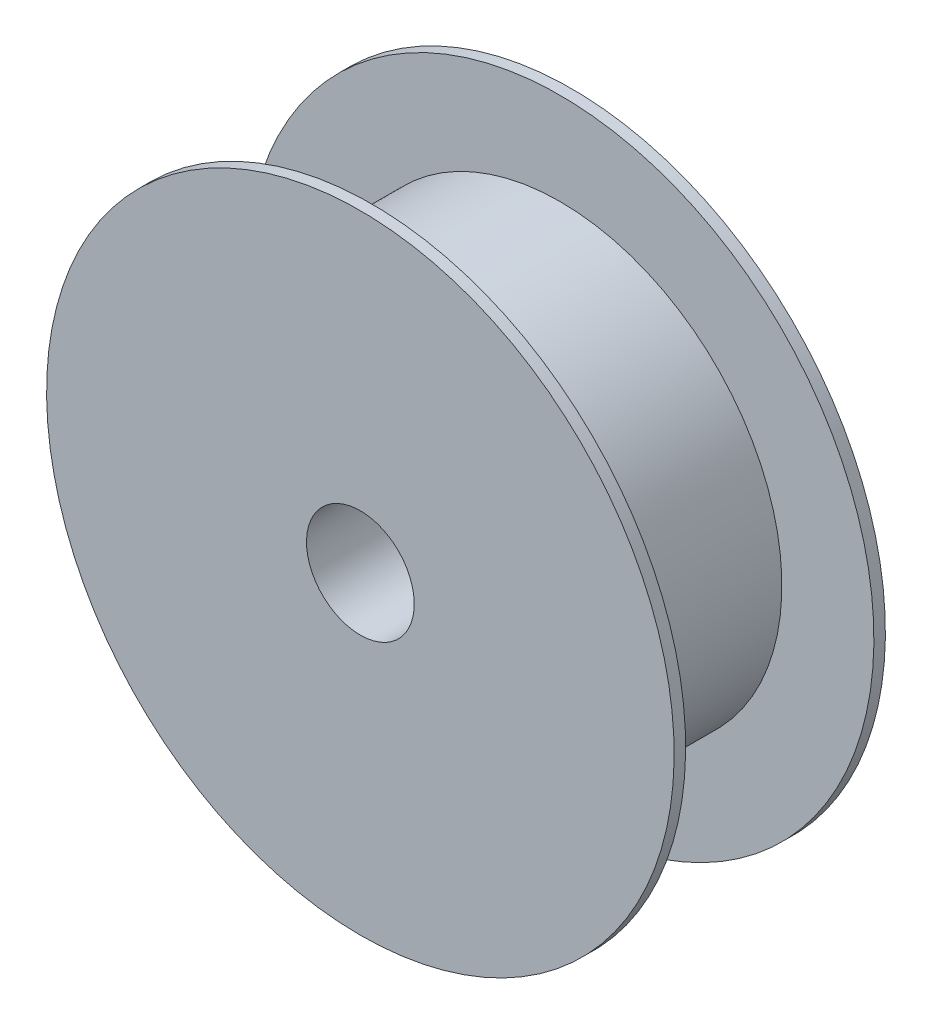
ISO-10303-21;
HEADER;
FILE_DESCRIPTION(('STEP AP214'),'2;1');
FILE_NAME('part.step','',(''),(''),'','','');
FILE_SCHEMA(('AUTOMOTIVE_DESIGN { 1 0 10303 214 1 1 1 1 }'));
ENDSEC;
DATA;
#1=APPLICATION_CONTEXT('core data for automotive mechanical design processes');
#2=APPLICATION_PROTOCOL_DEFINITION('international standard','automotive_design',2000,#1);
#3=PRODUCT_CONTEXT('',#1,'mechanical');
#4=PRODUCT('Part','Part','',(#3));
#5=PRODUCT_RELATED_PRODUCT_CATEGORY('part','',(#4));
#6=PRODUCT_DEFINITION_FORMATION('','',#4);
#7=PRODUCT_DEFINITION_CONTEXT('part definition',#1,'design');
#8=PRODUCT_DEFINITION('design','',#6,#7);
#9=PRODUCT_DEFINITION_SHAPE('','',#8);
#10=(LENGTH_UNIT() NAMED_UNIT(*) SI_UNIT(.MILLI.,.METRE.));
#11=(NAMED_UNIT(*) PLANE_ANGLE_UNIT() SI_UNIT($,.RADIAN.));
#12=(NAMED_UNIT(*) SI_UNIT($,.STERADIAN.) SOLID_ANGLE_UNIT());
#13=UNCERTAINTY_MEASURE_WITH_UNIT(LENGTH_MEASURE(1.E-05),#10,'distance_accuracy_value','');
#14=(GEOMETRIC_REPRESENTATION_CONTEXT(3) GLOBAL_UNCERTAINTY_ASSIGNED_CONTEXT((#13)) GLOBAL_UNIT_ASSIGNED_CONTEXT((#10,
#11,#12)) REPRESENTATION_CONTEXT('',''));
#15=CARTESIAN_POINT('',(0.,0.,0.));
#16=DIRECTION('',(0.,0.,1.));
#17=DIRECTION('',(1.,0.,0.));
#18=AXIS2_PLACEMENT_3D('',#15,#16,#17);
#19=CARTESIAN_POINT('',(0.,0.,50.5000000000001));
#20=DIRECTION('',(0.,0.,-1.));
#21=DIRECTION('',(0.,1.,0.));
#22=AXIS2_PLACEMENT_3D('',#19,#20,#21);
#23=PLANE('',#22);
#24=CARTESIAN_POINT('',(0.,0.,50.5));
#25=DIRECTION('',(0.,0.,1.));
#26=DIRECTION('',(0.,-1.,0.));
#27=AXIS2_PLACEMENT_3D('',#24,#25,#26);
#28=CIRCLE('',#27,25.7499999999999);
#29=CARTESIAN_POINT('',(0.,-25.7499999999999,50.5));
#30=VERTEX_POINT('',#29);
#31=EDGE_CURVE('E10',#30,#30,#28,.T.);
#32=ORIENTED_EDGE('',*,*,#31,.F.);
#33=EDGE_LOOP('',(#32));
#34=FACE_BOUND('',#33,.T.);
#35=CARTESIAN_POINT('',(0.,0.,50.5000000000001));
#36=DIRECTION('',(0.,0.,1.));
#37=DIRECTION('',(0.,-1.,0.));
#38=AXIS2_PLACEMENT_3D('',#35,#36,#37);
#39=CIRCLE('',#38,150.);
#40=CARTESIAN_POINT('',(0.,-150.,50.5000000000001));
#41=VERTEX_POINT('',#40);
#42=EDGE_CURVE('E60',#41,#41,#39,.T.);
#43=ORIENTED_EDGE('',*,*,#42,.T.);
#44=EDGE_LOOP('',(#43));
#45=FACE_BOUND('',#44,.T.);
#46=ADVANCED_FACE('F32',(#34,#45),#23,.F.);
#47=CARTESIAN_POINT('',(0.,0.,50.5));
#48=DIRECTION('',(0.,0.,1.));
#49=DIRECTION('',(0.,-1.,0.));
#50=AXIS2_PLACEMENT_3D('',#47,#48,#49);
#51=CYLINDRICAL_SURFACE('',#50,25.7499999999999);
#52=CARTESIAN_POINT('',(0.,0.,-50.5));
#53=DIRECTION('',(0.,0.,1.));
#54=DIRECTION('',(0.,-1.,0.));
#55=AXIS2_PLACEMENT_3D('',#52,#53,#54);
#56=CIRCLE('',#55,25.7499999999999);
#57=CARTESIAN_POINT('',(0.,-25.7499999999999,-50.5));
#58=VERTEX_POINT('',#57);
#59=EDGE_CURVE('E38',#58,#58,#56,.T.);
#60=ORIENTED_EDGE('',*,*,#59,.F.);
#61=EDGE_LOOP('',(#60));
#62=FACE_BOUND('',#61,.T.);
#63=ORIENTED_EDGE('',*,*,#31,.T.);
#64=EDGE_LOOP('',(#63));
#65=FACE_BOUND('',#64,.T.);
#66=ADVANCED_FACE('F77',(#62,#65),#51,.F.);
#67=CARTESIAN_POINT('',(0.,0.,-50.4999999999999));
#68=DIRECTION('',(0.,0.,-1.));
#69=DIRECTION('',(0.,1.,0.));
#70=AXIS2_PLACEMENT_3D('',#67,#68,#69);
#71=PLANE('',#70);
#72=ORIENTED_EDGE('',*,*,#59,.T.);
#73=EDGE_LOOP('',(#72));
#74=FACE_BOUND('',#73,.T.);
#75=CARTESIAN_POINT('',(0.,0.,-50.4999999999999));
#76=DIRECTION('',(0.,0.,1.));
#77=DIRECTION('',(0.,-1.,0.));
#78=AXIS2_PLACEMENT_3D('',#75,#76,#77);
#79=CIRCLE('',#78,150.);
#80=CARTESIAN_POINT('',(0.,-150.,-50.4999999999999));
#81=VERTEX_POINT('',#80);
#82=EDGE_CURVE('E42',#81,#81,#79,.T.);
#83=ORIENTED_EDGE('',*,*,#82,.F.);
#84=EDGE_LOOP('',(#83));
#85=FACE_BOUND('',#84,.T.);
#86=ADVANCED_FACE('F82',(#74,#85),#71,.T.);
#87=CARTESIAN_POINT('',(0.,0.,50.5));
#88=DIRECTION('',(0.,0.,1.));
#89=DIRECTION('',(0.,-1.,0.));
#90=AXIS2_PLACEMENT_3D('',#87,#88,#89);
#91=CYLINDRICAL_SURFACE('',#90,150.);
#92=ORIENTED_EDGE('',*,*,#82,.T.);
#93=EDGE_LOOP('',(#92));
#94=FACE_BOUND('',#93,.T.);
#95=CARTESIAN_POINT('',(0.,0.,-45.));
#96=DIRECTION('',(0.,0.,1.));
#97=DIRECTION('',(0.,-1.,0.));
#98=AXIS2_PLACEMENT_3D('',#95,#96,#97);
#99=CIRCLE('',#98,150.);
#100=CARTESIAN_POINT('',(0.,-150.,-45.));
#101=VERTEX_POINT('',#100);
#102=EDGE_CURVE('E46',#101,#101,#99,.T.);
#103=ORIENTED_EDGE('',*,*,#102,.F.);
#104=EDGE_LOOP('',(#103));
#105=FACE_BOUND('',#104,.T.);
#106=ADVANCED_FACE('F87',(#94,#105),#91,.T.);
#107=CARTESIAN_POINT('',(0.,0.,-45.));
#108=DIRECTION('',(0.,0.,-1.));
#109=DIRECTION('',(0.,1.,0.));
#110=AXIS2_PLACEMENT_3D('',#107,#108,#109);
#111=PLANE('',#110);
#112=CARTESIAN_POINT('',(0.,0.,-45.));
#113=DIRECTION('',(0.,0.,1.));
#114=DIRECTION('',(0.,-1.,0.));
#115=AXIS2_PLACEMENT_3D('',#112,#113,#114);
#116=CIRCLE('',#115,106.);
#117=CARTESIAN_POINT('',(0.,-106.,-45.));
#118=VERTEX_POINT('',#117);
#119=EDGE_CURVE('E51',#118,#118,#116,.T.);
#120=ORIENTED_EDGE('',*,*,#119,.F.);
#121=EDGE_LOOP('',(#120));
#122=FACE_BOUND('',#121,.T.);
#123=ORIENTED_EDGE('',*,*,#102,.T.);
#124=EDGE_LOOP('',(#123));
#125=FACE_BOUND('',#124,.T.);
#126=ADVANCED_FACE('F92',(#122,#125),#111,.F.);
#127=CARTESIAN_POINT('',(0.,0.,50.5));
#128=DIRECTION('',(0.,0.,1.));
#129=DIRECTION('',(0.,-1.,0.));
#130=AXIS2_PLACEMENT_3D('',#127,#128,#129);
#131=CYLINDRICAL_SURFACE('',#130,106.);
#132=CARTESIAN_POINT('',(0.,0.,45.));
#133=DIRECTION('',(0.,0.,1.));
#134=DIRECTION('',(0.,-1.,0.));
#135=AXIS2_PLACEMENT_3D('',#132,#133,#134);
#136=CIRCLE('',#135,106.);
#137=CARTESIAN_POINT('',(0.,-106.,45.));
#138=VERTEX_POINT('',#137);
#139=EDGE_CURVE('E54',#138,#138,#136,.T.);
#140=ORIENTED_EDGE('',*,*,#139,.F.);
#141=EDGE_LOOP('',(#140));
#142=FACE_BOUND('',#141,.T.);
#143=ORIENTED_EDGE('',*,*,#119,.T.);
#144=EDGE_LOOP('',(#143));
#145=FACE_BOUND('',#144,.T.);
#146=ADVANCED_FACE('F73',(#142,#145),#131,.T.);
#147=CARTESIAN_POINT('',(0.,0.,45.));
#148=DIRECTION('',(0.,0.,-1.));
#149=DIRECTION('',(0.,1.,0.));
#150=AXIS2_PLACEMENT_3D('',#147,#148,#149);
#151=PLANE('',#150);
#152=ORIENTED_EDGE('',*,*,#139,.T.);
#153=EDGE_LOOP('',(#152));
#154=FACE_BOUND('',#153,.T.);
#155=CARTESIAN_POINT('',(0.,0.,45.));
#156=DIRECTION('',(0.,0.,1.));
#157=DIRECTION('',(0.,-1.,0.));
#158=AXIS2_PLACEMENT_3D('',#155,#156,#157);
#159=CIRCLE('',#158,150.);
#160=CARTESIAN_POINT('',(0.,-150.,45.));
#161=VERTEX_POINT('',#160);
#162=EDGE_CURVE('E57',#161,#161,#159,.T.);
#163=ORIENTED_EDGE('',*,*,#162,.F.);
#164=EDGE_LOOP('',(#163));
#165=FACE_BOUND('',#164,.T.);
#166=ADVANCED_FACE('F67',(#154,#165),#151,.T.);
#167=CARTESIAN_POINT('',(0.,0.,50.5));
#168=DIRECTION('',(0.,0.,1.));
#169=DIRECTION('',(0.,-1.,0.));
#170=AXIS2_PLACEMENT_3D('',#167,#168,#169);
#171=CYLINDRICAL_SURFACE('',#170,150.);
#172=ORIENTED_EDGE('',*,*,#162,.T.);
#173=EDGE_LOOP('',(#172));
#174=FACE_BOUND('',#173,.T.);
#175=ORIENTED_EDGE('',*,*,#42,.F.);
#176=EDGE_LOOP('',(#175));
#177=FACE_BOUND('',#176,.T.);
#178=ADVANCED_FACE('F65',(#174,#177),#171,.T.);
#179=CLOSED_SHELL('',(#46,#66,#86,#106,#126,#146,#166,#178));
#180=MANIFOLD_SOLID_BREP('B2',#179);
#181=ADVANCED_BREP_SHAPE_REPRESENTATION('',(#18,#180),#14);
#182=SHAPE_DEFINITION_REPRESENTATION(#9,#181);
ENDSEC;
END-ISO-10303-21;
